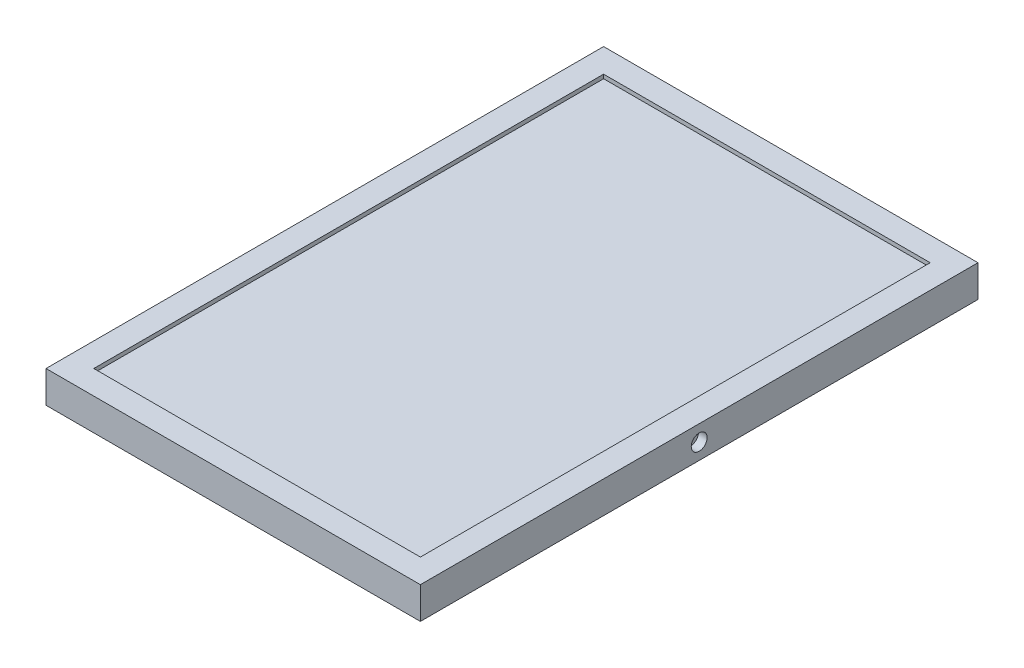
ISO-10303-21;
HEADER;
FILE_DESCRIPTION(('STEP AP214'),'2;1');
FILE_NAME('part.step','',(''),(''),'','','');
FILE_SCHEMA(('AUTOMOTIVE_DESIGN { 1 0 10303 214 1 1 1 1 }'));
ENDSEC;
DATA;
#1=APPLICATION_CONTEXT('core data for automotive mechanical design processes');
#2=APPLICATION_PROTOCOL_DEFINITION('international standard','automotive_design',2000,#1);
#3=PRODUCT_CONTEXT('',#1,'mechanical');
#4=PRODUCT('Part','Part','',(#3));
#5=PRODUCT_RELATED_PRODUCT_CATEGORY('part','',(#4));
#6=PRODUCT_DEFINITION_FORMATION('','',#4);
#7=PRODUCT_DEFINITION_CONTEXT('part definition',#1,'design');
#8=PRODUCT_DEFINITION('design','',#6,#7);
#9=PRODUCT_DEFINITION_SHAPE('','',#8);
#10=(LENGTH_UNIT() NAMED_UNIT(*) SI_UNIT(.MILLI.,.METRE.));
#11=(NAMED_UNIT(*) PLANE_ANGLE_UNIT() SI_UNIT($,.RADIAN.));
#12=(NAMED_UNIT(*) SI_UNIT($,.STERADIAN.) SOLID_ANGLE_UNIT());
#13=UNCERTAINTY_MEASURE_WITH_UNIT(LENGTH_MEASURE(1.E-05),#10,'distance_accuracy_value','');
#14=(GEOMETRIC_REPRESENTATION_CONTEXT(3) GLOBAL_UNCERTAINTY_ASSIGNED_CONTEXT((#13)) GLOBAL_UNIT_ASSIGNED_CONTEXT((#10,
#11,#12)) REPRESENTATION_CONTEXT('',''));
#15=CARTESIAN_POINT('',(0.,0.,0.));
#16=DIRECTION('',(0.,0.,1.));
#17=DIRECTION('',(1.,0.,0.));
#18=AXIS2_PLACEMENT_3D('',#15,#16,#17);
#19=CARTESIAN_POINT('',(0.,12.5,0.));
#20=DIRECTION('',(0.,1.,0.));
#21=DIRECTION('',(0.,0.,1.));
#22=AXIS2_PLACEMENT_3D('',#19,#20,#21);
#23=PLANE('',#22);
#24=DIRECTION('',(0.,0.,-1.));
#25=VECTOR('',#24,1.);
#26=CARTESIAN_POINT('',(-102.5,12.5,0.));
#27=LINE('',#26,#25);
#28=CARTESIAN_POINT('',(-102.5,12.5,160.));
#29=VERTEX_POINT('',#28);
#30=CARTESIAN_POINT('',(-102.5,12.5,-160.));
#31=VERTEX_POINT('',#30);
#32=EDGE_CURVE('E189',#29,#31,#27,.T.);
#33=ORIENTED_EDGE('',*,*,#32,.T.);
#34=DIRECTION('',(1.,0.,0.));
#35=VECTOR('',#34,1.);
#36=CARTESIAN_POINT('',(0.,12.5,-160.));
#37=LINE('',#36,#35);
#38=CARTESIAN_POINT('',(102.5,12.5,-160.));
#39=VERTEX_POINT('',#38);
#40=EDGE_CURVE('E197',#31,#39,#37,.T.);
#41=ORIENTED_EDGE('',*,*,#40,.T.);
#42=DIRECTION('',(0.,0.,-1.));
#43=VECTOR('',#42,1.);
#44=CARTESIAN_POINT('',(102.5,12.5,0.));
#45=LINE('',#44,#43);
#46=CARTESIAN_POINT('',(102.5,12.5,160.));
#47=VERTEX_POINT('',#46);
#48=EDGE_CURVE('E194',#47,#39,#45,.T.);
#49=ORIENTED_EDGE('',*,*,#48,.F.);
#50=DIRECTION('',(1.,0.,0.));
#51=VECTOR('',#50,1.);
#52=CARTESIAN_POINT('',(0.,12.5,160.));
#53=LINE('',#52,#51);
#54=EDGE_CURVE('E191',#29,#47,#53,.T.);
#55=ORIENTED_EDGE('',*,*,#54,.F.);
#56=EDGE_LOOP('',(#33,#41,#49,#55));
#57=FACE_BOUND('',#56,.T.);
#58=DIRECTION('',(0.,0.,1.));
#59=VECTOR('',#58,1.);
#60=CARTESIAN_POINT('',(71.25,12.5,-25.));
#61=LINE('',#60,#59);
#62=CARTESIAN_POINT('',(71.25,12.5,-25.));
#63=VERTEX_POINT('',#62);
#64=CARTESIAN_POINT('',(71.25,12.5,25.));
#65=VERTEX_POINT('',#64);
#66=EDGE_CURVE('E173',#63,#65,#61,.T.);
#67=ORIENTED_EDGE('',*,*,#66,.F.);
#68=DIRECTION('',(1.,0.,0.));
#69=VECTOR('',#68,1.);
#70=CARTESIAN_POINT('',(31.25,12.5,-25.));
#71=LINE('',#70,#69);
#72=CARTESIAN_POINT('',(31.25,12.5,-25.));
#73=VERTEX_POINT('',#72);
#74=EDGE_CURVE('E170',#73,#63,#71,.T.);
#75=ORIENTED_EDGE('',*,*,#74,.F.);
#76=DIRECTION('',(0.,0.,-1.));
#77=VECTOR('',#76,1.);
#78=CARTESIAN_POINT('',(31.25,12.5,-25.));
#79=LINE('',#78,#77);
#80=CARTESIAN_POINT('',(31.25,12.5,25.));
#81=VERTEX_POINT('',#80);
#82=EDGE_CURVE('E60',#81,#73,#79,.T.);
#83=ORIENTED_EDGE('',*,*,#82,.F.);
#84=DIRECTION('',(-1.,0.,0.));
#85=VECTOR('',#84,1.);
#86=CARTESIAN_POINT('',(31.25,12.5,25.));
#87=LINE('',#86,#85);
#88=EDGE_CURVE('E55',#65,#81,#87,.T.);
#89=ORIENTED_EDGE('',*,*,#88,.F.);
#90=EDGE_LOOP('',(#67,#75,#83,#89));
#91=FACE_BOUND('',#90,.T.);
#92=ADVANCED_FACE('F40',(#57,#91),#23,.F.);
#93=CARTESIAN_POINT('',(-102.5,20.,160.));
#94=DIRECTION('',(0.,0.,-1.));
#95=DIRECTION('',(-1.,0.,0.));
#96=AXIS2_PLACEMENT_3D('',#93,#94,#95);
#97=PLANE('',#96);
#98=DIRECTION('',(0.,-1.,0.));
#99=VECTOR('',#98,1.);
#100=CARTESIAN_POINT('',(-102.5,20.,160.));
#101=LINE('',#100,#99);
#102=CARTESIAN_POINT('',(-102.5,0.,160.));
#103=VERTEX_POINT('',#102);
#104=EDGE_CURVE('E210',#29,#103,#101,.T.);
#105=ORIENTED_EDGE('',*,*,#104,.F.);
#106=ORIENTED_EDGE('',*,*,#54,.T.);
#107=DIRECTION('',(0.,-1.,0.));
#108=VECTOR('',#107,1.);
#109=CARTESIAN_POINT('',(102.5,20.,160.));
#110=LINE('',#109,#108);
#111=CARTESIAN_POINT('',(102.5,0.,160.));
#112=VERTEX_POINT('',#111);
#113=EDGE_CURVE('E231',#47,#112,#110,.T.);
#114=ORIENTED_EDGE('',*,*,#113,.T.);
#115=DIRECTION('',(1.,0.,0.));
#116=VECTOR('',#115,1.);
#117=CARTESIAN_POINT('',(-102.5,0.,160.));
#118=LINE('',#117,#116);
#119=EDGE_CURVE('E199',#103,#112,#118,.T.);
#120=ORIENTED_EDGE('',*,*,#119,.F.);
#121=EDGE_LOOP('',(#105,#106,#114,#120));
#122=FACE_BOUND('',#121,.T.);
#123=ADVANCED_FACE('F291',(#122),#97,.T.);
#124=CARTESIAN_POINT('',(102.5,20.,160.));
#125=DIRECTION('',(-1.,0.,0.));
#126=DIRECTION('',(0.,0.,1.));
#127=AXIS2_PLACEMENT_3D('',#124,#125,#126);
#128=PLANE('',#127);
#129=ORIENTED_EDGE('',*,*,#113,.F.);
#130=ORIENTED_EDGE('',*,*,#48,.T.);
#131=DIRECTION('',(0.,-1.,0.));
#132=VECTOR('',#131,1.);
#133=CARTESIAN_POINT('',(102.5,20.,-160.));
#134=LINE('',#133,#132);
#135=CARTESIAN_POINT('',(102.5,0.,-160.));
#136=VERTEX_POINT('',#135);
#137=EDGE_CURVE('E227',#39,#136,#134,.T.);
#138=ORIENTED_EDGE('',*,*,#137,.T.);
#139=DIRECTION('',(0.,0.,-1.));
#140=VECTOR('',#139,1.);
#141=CARTESIAN_POINT('',(102.5,0.,160.));
#142=LINE('',#141,#140);
#143=EDGE_CURVE('E213',#112,#136,#142,.T.);
#144=ORIENTED_EDGE('',*,*,#143,.F.);
#145=EDGE_LOOP('',(#129,#130,#138,#144));
#146=FACE_BOUND('',#145,.T.);
#147=ADVANCED_FACE('F297',(#146),#128,.T.);
#148=CARTESIAN_POINT('',(-102.5,20.,-160.));
#149=DIRECTION('',(0.,0.,1.));
#150=DIRECTION('',(1.,0.,0.));
#151=AXIS2_PLACEMENT_3D('',#148,#149,#150);
#152=PLANE('',#151);
#153=ORIENTED_EDGE('',*,*,#137,.F.);
#154=ORIENTED_EDGE('',*,*,#40,.F.);
#155=DIRECTION('',(0.,-1.,0.));
#156=VECTOR('',#155,1.);
#157=CARTESIAN_POINT('',(-102.5,20.,-160.));
#158=LINE('',#157,#156);
#159=CARTESIAN_POINT('',(-102.5,0.,-160.));
#160=VERTEX_POINT('',#159);
#161=EDGE_CURVE('E223',#31,#160,#158,.T.);
#162=ORIENTED_EDGE('',*,*,#161,.T.);
#163=DIRECTION('',(-1.,0.,0.));
#164=VECTOR('',#163,1.);
#165=CARTESIAN_POINT('',(-102.5,0.,-160.));
#166=LINE('',#165,#164);
#167=EDGE_CURVE('E216',#136,#160,#166,.T.);
#168=ORIENTED_EDGE('',*,*,#167,.F.);
#169=EDGE_LOOP('',(#153,#154,#162,#168));
#170=FACE_BOUND('',#169,.T.);
#171=ADVANCED_FACE('F315',(#170),#152,.T.);
#172=CARTESIAN_POINT('',(-102.5,20.,160.));
#173=DIRECTION('',(1.,0.,0.));
#174=DIRECTION('',(0.,0.,-1.));
#175=AXIS2_PLACEMENT_3D('',#172,#173,#174);
#176=PLANE('',#175);
#177=ORIENTED_EDGE('',*,*,#161,.F.);
#178=ORIENTED_EDGE('',*,*,#32,.F.);
#179=ORIENTED_EDGE('',*,*,#104,.T.);
#180=DIRECTION('',(0.,0.,1.));
#181=VECTOR('',#180,1.);
#182=CARTESIAN_POINT('',(-102.5,0.,160.));
#183=LINE('',#182,#181);
#184=EDGE_CURVE('E203',#160,#103,#183,.T.);
#185=ORIENTED_EDGE('',*,*,#184,.F.);
#186=EDGE_LOOP('',(#177,#178,#179,#185));
#187=FACE_BOUND('',#186,.T.);
#188=ADVANCED_FACE('F310',(#187),#176,.T.);
#189=CARTESIAN_POINT('',(0.,20.,0.));
#190=DIRECTION('',(0.,-1.,0.));
#191=DIRECTION('',(0.,0.,-1.));
#192=AXIS2_PLACEMENT_3D('',#189,#190,#191);
#193=PLANE('',#192);
#194=DIRECTION('',(0.,0.,-1.));
#195=VECTOR('',#194,1.);
#196=CARTESIAN_POINT('',(117.5,20.,175.));
#197=LINE('',#196,#195);
#198=CARTESIAN_POINT('',(117.5,20.,175.));
#199=VERTEX_POINT('',#198);
#200=CARTESIAN_POINT('',(117.5,20.,-175.));
#201=VERTEX_POINT('',#200);
#202=EDGE_CURVE('E236',#199,#201,#197,.T.);
#203=ORIENTED_EDGE('',*,*,#202,.T.);
#204=DIRECTION('',(-1.,0.,0.));
#205=VECTOR('',#204,1.);
#206=CARTESIAN_POINT('',(-117.5,20.,-175.));
#207=LINE('',#206,#205);
#208=CARTESIAN_POINT('',(-117.5,20.,-175.));
#209=VERTEX_POINT('',#208);
#210=EDGE_CURVE('E239',#201,#209,#207,.T.);
#211=ORIENTED_EDGE('',*,*,#210,.T.);
#212=DIRECTION('',(0.,0.,1.));
#213=VECTOR('',#212,1.);
#214=CARTESIAN_POINT('',(-117.5,20.,175.));
#215=LINE('',#214,#213);
#216=CARTESIAN_POINT('',(-117.5,20.,175.));
#217=VERTEX_POINT('',#216);
#218=EDGE_CURVE('E242',#209,#217,#215,.T.);
#219=ORIENTED_EDGE('',*,*,#218,.T.);
#220=DIRECTION('',(1.,0.,0.));
#221=VECTOR('',#220,1.);
#222=CARTESIAN_POINT('',(-117.5,20.,175.));
#223=LINE('',#222,#221);
#224=EDGE_CURVE('E244',#217,#199,#223,.T.);
#225=ORIENTED_EDGE('',*,*,#224,.T.);
#226=EDGE_LOOP('',(#203,#211,#219,#225));
#227=FACE_BOUND('',#226,.T.);
#228=DIRECTION('',(1.,0.,0.));
#229=VECTOR('',#228,1.);
#230=CARTESIAN_POINT('',(-102.5,20.,160.));
#231=LINE('',#230,#229);
#232=CARTESIAN_POINT('',(-102.5,20.,160.));
#233=VERTEX_POINT('',#232);
#234=CARTESIAN_POINT('',(102.5,20.,160.));
#235=VERTEX_POINT('',#234);
#236=EDGE_CURVE('E200',#233,#235,#231,.T.);
#237=ORIENTED_EDGE('',*,*,#236,.F.);
#238=DIRECTION('',(0.,0.,1.));
#239=VECTOR('',#238,1.);
#240=CARTESIAN_POINT('',(-102.5,20.,160.));
#241=LINE('',#240,#239);
#242=CARTESIAN_POINT('',(-102.5,20.,-160.));
#243=VERTEX_POINT('',#242);
#244=EDGE_CURVE('E208',#243,#233,#241,.T.);
#245=ORIENTED_EDGE('',*,*,#244,.F.);
#246=DIRECTION('',(-1.,0.,0.));
#247=VECTOR('',#246,1.);
#248=CARTESIAN_POINT('',(-102.5,20.,-160.));
#249=LINE('',#248,#247);
#250=CARTESIAN_POINT('',(102.5,20.,-160.));
#251=VERTEX_POINT('',#250);
#252=EDGE_CURVE('E205',#251,#243,#249,.T.);
#253=ORIENTED_EDGE('',*,*,#252,.F.);
#254=DIRECTION('',(0.,0.,-1.));
#255=VECTOR('',#254,1.);
#256=CARTESIAN_POINT('',(102.5,20.,160.));
#257=LINE('',#256,#255);
#258=EDGE_CURVE('E202',#235,#251,#257,.T.);
#259=ORIENTED_EDGE('',*,*,#258,.F.);
#260=EDGE_LOOP('',(#237,#245,#253,#259));
#261=FACE_BOUND('',#260,.T.);
#262=ADVANCED_FACE('F279',(#227,#261),#193,.F.);
#263=CARTESIAN_POINT('',(0.,0.,0.));
#264=DIRECTION('',(0.,-1.,0.));
#265=DIRECTION('',(0.,0.,-1.));
#266=AXIS2_PLACEMENT_3D('',#263,#264,#265);
#267=PLANE('',#266);
#268=DIRECTION('',(0.,0.,-1.));
#269=VECTOR('',#268,1.);
#270=CARTESIAN_POINT('',(117.5,0.,175.));
#271=LINE('',#270,#269);
#272=CARTESIAN_POINT('',(117.5,0.,175.));
#273=VERTEX_POINT('',#272);
#274=CARTESIAN_POINT('',(117.5,0.,-175.));
#275=VERTEX_POINT('',#274);
#276=EDGE_CURVE('E235',#273,#275,#271,.T.);
#277=ORIENTED_EDGE('',*,*,#276,.F.);
#278=DIRECTION('',(1.,0.,0.));
#279=VECTOR('',#278,1.);
#280=CARTESIAN_POINT('',(-117.5,0.,175.));
#281=LINE('',#280,#279);
#282=CARTESIAN_POINT('',(-117.5,0.,175.));
#283=VERTEX_POINT('',#282);
#284=EDGE_CURVE('E240',#283,#273,#281,.T.);
#285=ORIENTED_EDGE('',*,*,#284,.F.);
#286=DIRECTION('',(0.,0.,1.));
#287=VECTOR('',#286,1.);
#288=CARTESIAN_POINT('',(-117.5,0.,175.));
#289=LINE('',#288,#287);
#290=CARTESIAN_POINT('',(-117.5,0.,-175.));
#291=VERTEX_POINT('',#290);
#292=EDGE_CURVE('E251',#291,#283,#289,.T.);
#293=ORIENTED_EDGE('',*,*,#292,.F.);
#294=DIRECTION('',(-1.,0.,0.));
#295=VECTOR('',#294,1.);
#296=CARTESIAN_POINT('',(-117.5,0.,-175.));
#297=LINE('',#296,#295);
#298=EDGE_CURVE('E249',#275,#291,#297,.T.);
#299=ORIENTED_EDGE('',*,*,#298,.F.);
#300=EDGE_LOOP('',(#277,#285,#293,#299));
#301=FACE_BOUND('',#300,.T.);
#302=ORIENTED_EDGE('',*,*,#184,.T.);
#303=ORIENTED_EDGE('',*,*,#119,.T.);
#304=ORIENTED_EDGE('',*,*,#143,.T.);
#305=ORIENTED_EDGE('',*,*,#167,.T.);
#306=EDGE_LOOP('',(#302,#303,#304,#305));
#307=FACE_BOUND('',#306,.T.);
#308=ADVANCED_FACE('F269',(#301,#307),#267,.T.);
#309=CARTESIAN_POINT('',(117.5,20.,175.));
#310=DIRECTION('',(-1.,0.,0.));
#311=DIRECTION('',(0.,0.,1.));
#312=AXIS2_PLACEMENT_3D('',#309,#310,#311);
#313=PLANE('',#312);
#314=CARTESIAN_POINT('',(117.5,10.,0.));
#315=DIRECTION('',(-1.,0.,0.));
#316=DIRECTION('',(0.,0.,1.));
#317=AXIS2_PLACEMENT_3D('',#314,#315,#316);
#318=CIRCLE('',#317,5.);
#319=CARTESIAN_POINT('',(117.5,10.,4.99999999999999));
#320=VERTEX_POINT('',#319);
#321=EDGE_CURVE('E589',#320,#320,#318,.T.);
#322=ORIENTED_EDGE('',*,*,#321,.T.);
#323=EDGE_LOOP('',(#322));
#324=FACE_BOUND('',#323,.T.);
#325=ORIENTED_EDGE('',*,*,#276,.T.);
#326=DIRECTION('',(0.,-1.,0.));
#327=VECTOR('',#326,1.);
#328=CARTESIAN_POINT('',(117.5,20.,-175.));
#329=LINE('',#328,#327);
#330=EDGE_CURVE('E11',#201,#275,#329,.T.);
#331=ORIENTED_EDGE('',*,*,#330,.F.);
#332=ORIENTED_EDGE('',*,*,#202,.F.);
#333=DIRECTION('',(0.,-1.,0.));
#334=VECTOR('',#333,1.);
#335=CARTESIAN_POINT('',(117.5,20.,175.));
#336=LINE('',#335,#334);
#337=EDGE_CURVE('E246',#199,#273,#336,.T.);
#338=ORIENTED_EDGE('',*,*,#337,.T.);
#339=EDGE_LOOP('',(#325,#331,#332,#338));
#340=FACE_BOUND('',#339,.T.);
#341=ADVANCED_FACE('F42',(#324,#340),#313,.F.);
#342=CARTESIAN_POINT('',(-117.5,20.,-175.));
#343=DIRECTION('',(0.,0.,1.));
#344=DIRECTION('',(1.,0.,0.));
#345=AXIS2_PLACEMENT_3D('',#342,#343,#344);
#346=PLANE('',#345);
#347=ORIENTED_EDGE('',*,*,#298,.T.);
#348=DIRECTION('',(0.,-1.,0.));
#349=VECTOR('',#348,1.);
#350=CARTESIAN_POINT('',(-117.5,20.,-175.));
#351=LINE('',#350,#349);
#352=EDGE_CURVE('E48',#209,#291,#351,.T.);
#353=ORIENTED_EDGE('',*,*,#352,.F.);
#354=ORIENTED_EDGE('',*,*,#210,.F.);
#355=ORIENTED_EDGE('',*,*,#330,.T.);
#356=EDGE_LOOP('',(#347,#353,#354,#355));
#357=FACE_BOUND('',#356,.T.);
#358=ADVANCED_FACE('F281',(#357),#346,.F.);
#359=CARTESIAN_POINT('',(-117.5,20.,175.));
#360=DIRECTION('',(1.,0.,0.));
#361=DIRECTION('',(0.,0.,-1.));
#362=AXIS2_PLACEMENT_3D('',#359,#360,#361);
#363=PLANE('',#362);
#364=CARTESIAN_POINT('',(-117.5,10.,0.));
#365=DIRECTION('',(-1.,0.,0.));
#366=DIRECTION('',(0.,0.,1.));
#367=AXIS2_PLACEMENT_3D('',#364,#365,#366);
#368=CIRCLE('',#367,5.);
#369=CARTESIAN_POINT('',(-117.5,10.,4.99999999999999));
#370=VERTEX_POINT('',#369);
#371=EDGE_CURVE('E588',#370,#370,#368,.T.);
#372=ORIENTED_EDGE('',*,*,#371,.F.);
#373=EDGE_LOOP('',(#372));
#374=FACE_BOUND('',#373,.T.);
#375=ORIENTED_EDGE('',*,*,#292,.T.);
#376=DIRECTION('',(0.,-1.,0.));
#377=VECTOR('',#376,1.);
#378=CARTESIAN_POINT('',(-117.5,20.,175.));
#379=LINE('',#378,#377);
#380=EDGE_CURVE('E256',#217,#283,#379,.T.);
#381=ORIENTED_EDGE('',*,*,#380,.F.);
#382=ORIENTED_EDGE('',*,*,#218,.F.);
#383=ORIENTED_EDGE('',*,*,#352,.T.);
#384=EDGE_LOOP('',(#375,#381,#382,#383));
#385=FACE_BOUND('',#384,.T.);
#386=ADVANCED_FACE('F263',(#374,#385),#363,.F.);
#387=CARTESIAN_POINT('',(-117.5,20.,175.));
#388=DIRECTION('',(0.,0.,-1.));
#389=DIRECTION('',(-1.,0.,0.));
#390=AXIS2_PLACEMENT_3D('',#387,#388,#389);
#391=PLANE('',#390);
#392=ORIENTED_EDGE('',*,*,#284,.T.);
#393=ORIENTED_EDGE('',*,*,#337,.F.);
#394=ORIENTED_EDGE('',*,*,#224,.F.);
#395=ORIENTED_EDGE('',*,*,#380,.T.);
#396=EDGE_LOOP('',(#392,#393,#394,#395));
#397=FACE_BOUND('',#396,.T.);
#398=ADVANCED_FACE('F273',(#397),#391,.F.);
#399=DIRECTION('',(1.,0.,0.));
#400=VECTOR('',#399,1.);
#401=CARTESIAN_POINT('',(0.,17.5,160.));
#402=LINE('',#401,#400);
#403=CARTESIAN_POINT('',(-102.5,17.5,160.));
#404=VERTEX_POINT('',#403);
#405=CARTESIAN_POINT('',(102.5,17.5,160.));
#406=VERTEX_POINT('',#405);
#407=EDGE_CURVE('E176',#404,#406,#402,.T.);
#408=ORIENTED_EDGE('',*,*,#407,.F.);
#409=EDGE_CURVE('E221',#233,#404,#101,.T.);
#410=ORIENTED_EDGE('',*,*,#409,.F.);
#411=ORIENTED_EDGE('',*,*,#236,.T.);
#412=EDGE_CURVE('E232',#235,#406,#110,.T.);
#413=ORIENTED_EDGE('',*,*,#412,.T.);
#414=EDGE_LOOP('',(#408,#410,#411,#413));
#415=FACE_BOUND('',#414,.T.);
#416=ADVANCED_FACE('F300',(#415),#97,.T.);
#417=DIRECTION('',(0.,0.,-1.));
#418=VECTOR('',#417,1.);
#419=CARTESIAN_POINT('',(102.5,17.5,0.));
#420=LINE('',#419,#418);
#421=CARTESIAN_POINT('',(102.5,17.5,-160.));
#422=VERTEX_POINT('',#421);
#423=EDGE_CURVE('E184',#406,#422,#420,.T.);
#424=ORIENTED_EDGE('',*,*,#423,.F.);
#425=ORIENTED_EDGE('',*,*,#412,.F.);
#426=ORIENTED_EDGE('',*,*,#258,.T.);
#427=EDGE_CURVE('E228',#251,#422,#134,.T.);
#428=ORIENTED_EDGE('',*,*,#427,.T.);
#429=EDGE_LOOP('',(#424,#425,#426,#428));
#430=FACE_BOUND('',#429,.T.);
#431=ADVANCED_FACE('F313',(#430),#128,.T.);
#432=DIRECTION('',(1.,0.,0.));
#433=VECTOR('',#432,1.);
#434=CARTESIAN_POINT('',(0.,17.5,-160.));
#435=LINE('',#434,#433);
#436=CARTESIAN_POINT('',(-102.5,17.5,-160.));
#437=VERTEX_POINT('',#436);
#438=EDGE_CURVE('E187',#437,#422,#435,.T.);
#439=ORIENTED_EDGE('',*,*,#438,.T.);
#440=ORIENTED_EDGE('',*,*,#427,.F.);
#441=ORIENTED_EDGE('',*,*,#252,.T.);
#442=EDGE_CURVE('E224',#243,#437,#158,.T.);
#443=ORIENTED_EDGE('',*,*,#442,.T.);
#444=EDGE_LOOP('',(#439,#440,#441,#443));
#445=FACE_BOUND('',#444,.T.);
#446=ADVANCED_FACE('F308',(#445),#152,.T.);
#447=DIRECTION('',(0.,0.,-1.));
#448=VECTOR('',#447,1.);
#449=CARTESIAN_POINT('',(-102.5,17.5,0.));
#450=LINE('',#449,#448);
#451=EDGE_CURVE('E174',#404,#437,#450,.T.);
#452=ORIENTED_EDGE('',*,*,#451,.T.);
#453=ORIENTED_EDGE('',*,*,#442,.F.);
#454=ORIENTED_EDGE('',*,*,#244,.T.);
#455=ORIENTED_EDGE('',*,*,#409,.T.);
#456=EDGE_LOOP('',(#452,#453,#454,#455));
#457=FACE_BOUND('',#456,.T.);
#458=ADVANCED_FACE('F305',(#457),#176,.T.);
#459=CARTESIAN_POINT('',(0.,17.5,0.));
#460=DIRECTION('',(0.,1.,0.));
#461=DIRECTION('',(0.,0.,1.));
#462=AXIS2_PLACEMENT_3D('',#459,#460,#461);
#463=PLANE('',#462);
#464=ORIENTED_EDGE('',*,*,#451,.F.);
#465=ORIENTED_EDGE('',*,*,#407,.T.);
#466=ORIENTED_EDGE('',*,*,#423,.T.);
#467=ORIENTED_EDGE('',*,*,#438,.F.);
#468=EDGE_LOOP('',(#464,#465,#466,#467));
#469=FACE_BOUND('',#468,.T.);
#470=ADVANCED_FACE('F303',(#469),#463,.T.);
#471=CARTESIAN_POINT('',(71.25,0.,-25.));
#472=DIRECTION('',(-1.,0.,0.));
#473=DIRECTION('',(0.,0.,1.));
#474=AXIS2_PLACEMENT_3D('',#471,#472,#473);
#475=PLANE('',#474);
#476=ORIENTED_EDGE('',*,*,#66,.T.);
#477=DIRECTION('',(0.,1.,0.));
#478=VECTOR('',#477,1.);
#479=CARTESIAN_POINT('',(71.25,0.,25.));
#480=LINE('',#479,#478);
#481=CARTESIAN_POINT('',(71.25,0.,25.));
#482=VERTEX_POINT('',#481);
#483=EDGE_CURVE('E154',#482,#65,#480,.T.);
#484=ORIENTED_EDGE('',*,*,#483,.F.);
#485=DIRECTION('',(0.,0.,1.));
#486=VECTOR('',#485,1.);
#487=CARTESIAN_POINT('',(71.25,0.,-25.));
#488=LINE('',#487,#486);
#489=CARTESIAN_POINT('',(71.25,0.,-25.));
#490=VERTEX_POINT('',#489);
#491=EDGE_CURVE('E161',#490,#482,#488,.T.);
#492=ORIENTED_EDGE('',*,*,#491,.F.);
#493=DIRECTION('',(0.,1.,0.));
#494=VECTOR('',#493,1.);
#495=CARTESIAN_POINT('',(71.25,0.,-25.));
#496=LINE('',#495,#494);
#497=EDGE_CURVE('E601',#490,#63,#496,.T.);
#498=ORIENTED_EDGE('',*,*,#497,.T.);
#499=EDGE_LOOP('',(#476,#484,#492,#498));
#500=FACE_BOUND('',#499,.T.);
#501=ADVANCED_FACE('F172',(#500),#475,.F.);
#502=CARTESIAN_POINT('',(31.25,0.,25.));
#503=DIRECTION('',(0.,0.,-1.));
#504=DIRECTION('',(-1.,0.,0.));
#505=AXIS2_PLACEMENT_3D('',#502,#503,#504);
#506=PLANE('',#505);
#507=ORIENTED_EDGE('',*,*,#88,.T.);
#508=DIRECTION('',(0.,1.,0.));
#509=VECTOR('',#508,1.);
#510=CARTESIAN_POINT('',(31.25,0.,25.));
#511=LINE('',#510,#509);
#512=CARTESIAN_POINT('',(31.25,0.,25.));
#513=VERTEX_POINT('',#512);
#514=EDGE_CURVE('E157',#513,#81,#511,.T.);
#515=ORIENTED_EDGE('',*,*,#514,.F.);
#516=DIRECTION('',(-1.,0.,0.));
#517=VECTOR('',#516,1.);
#518=CARTESIAN_POINT('',(31.25,0.,25.));
#519=LINE('',#518,#517);
#520=EDGE_CURVE('E150',#482,#513,#519,.T.);
#521=ORIENTED_EDGE('',*,*,#520,.F.);
#522=ORIENTED_EDGE('',*,*,#483,.T.);
#523=EDGE_LOOP('',(#507,#515,#521,#522));
#524=FACE_BOUND('',#523,.T.);
#525=ADVANCED_FACE('F152',(#524),#506,.F.);
#526=CARTESIAN_POINT('',(31.25,0.,-25.));
#527=DIRECTION('',(1.,0.,0.));
#528=DIRECTION('',(0.,0.,-1.));
#529=AXIS2_PLACEMENT_3D('',#526,#527,#528);
#530=PLANE('',#529);
#531=ORIENTED_EDGE('',*,*,#82,.T.);
#532=DIRECTION('',(0.,1.,0.));
#533=VECTOR('',#532,1.);
#534=CARTESIAN_POINT('',(31.25,0.,-25.));
#535=LINE('',#534,#533);
#536=CARTESIAN_POINT('',(31.25,0.,-25.));
#537=VERTEX_POINT('',#536);
#538=EDGE_CURVE('E178',#537,#73,#535,.T.);
#539=ORIENTED_EDGE('',*,*,#538,.F.);
#540=DIRECTION('',(0.,0.,-1.));
#541=VECTOR('',#540,1.);
#542=CARTESIAN_POINT('',(31.25,0.,-25.));
#543=LINE('',#542,#541);
#544=EDGE_CURVE('E160',#513,#537,#543,.T.);
#545=ORIENTED_EDGE('',*,*,#544,.F.);
#546=ORIENTED_EDGE('',*,*,#514,.T.);
#547=EDGE_LOOP('',(#531,#539,#545,#546));
#548=FACE_BOUND('',#547,.T.);
#549=ADVANCED_FACE('F367',(#548),#530,.F.);
#550=CARTESIAN_POINT('',(31.25,0.,-25.));
#551=DIRECTION('',(0.,0.,1.));
#552=DIRECTION('',(1.,0.,0.));
#553=AXIS2_PLACEMENT_3D('',#550,#551,#552);
#554=PLANE('',#553);
#555=ORIENTED_EDGE('',*,*,#74,.T.);
#556=ORIENTED_EDGE('',*,*,#497,.F.);
#557=DIRECTION('',(1.,0.,0.));
#558=VECTOR('',#557,1.);
#559=CARTESIAN_POINT('',(31.25,0.,-25.));
#560=LINE('',#559,#558);
#561=EDGE_CURVE('E166',#537,#490,#560,.T.);
#562=ORIENTED_EDGE('',*,*,#561,.F.);
#563=ORIENTED_EDGE('',*,*,#538,.T.);
#564=EDGE_LOOP('',(#555,#556,#562,#563));
#565=FACE_BOUND('',#564,.T.);
#566=ADVANCED_FACE('F374',(#565),#554,.F.);
#567=CARTESIAN_POINT('',(0.,0.,0.));
#568=DIRECTION('',(0.,1.,0.));
#569=DIRECTION('',(0.,0.,1.));
#570=AXIS2_PLACEMENT_3D('',#567,#568,#569);
#571=PLANE('',#570);
#572=ORIENTED_EDGE('',*,*,#491,.T.);
#573=ORIENTED_EDGE('',*,*,#520,.T.);
#574=ORIENTED_EDGE('',*,*,#544,.T.);
#575=ORIENTED_EDGE('',*,*,#561,.T.);
#576=EDGE_LOOP('',(#572,#573,#574,#575));
#577=FACE_BOUND('',#576,.T.);
#578=ADVANCED_FACE('F164',(#577),#571,.F.);
#579=CARTESIAN_POINT('',(-112.,10.,0.));
#580=DIRECTION('',(-1.,0.,0.));
#581=DIRECTION('',(0.,0.,1.));
#582=AXIS2_PLACEMENT_3D('',#579,#580,#581);
#583=CYLINDRICAL_SURFACE('',#582,5.);
#584=CARTESIAN_POINT('',(-112.,10.,0.));
#585=DIRECTION('',(-1.,0.,0.));
#586=DIRECTION('',(0.,0.,1.));
#587=AXIS2_PLACEMENT_3D('',#584,#585,#586);
#588=CIRCLE('',#587,5.);
#589=CARTESIAN_POINT('',(-112.,10.,4.99999999999999));
#590=VERTEX_POINT('',#589);
#591=EDGE_CURVE('E592',#590,#590,#588,.T.);
#592=ORIENTED_EDGE('',*,*,#591,.F.);
#593=EDGE_LOOP('',(#592));
#594=FACE_BOUND('',#593,.T.);
#595=ORIENTED_EDGE('',*,*,#371,.T.);
#596=EDGE_LOOP('',(#595));
#597=FACE_BOUND('',#596,.T.);
#598=ADVANCED_FACE('F387',(#594,#597),#583,.F.);
#599=CARTESIAN_POINT('',(-112.,10.,0.));
#600=DIRECTION('',(-1.,0.,0.));
#601=DIRECTION('',(0.,0.,1.));
#602=AXIS2_PLACEMENT_3D('',#599,#600,#601);
#603=PLANE('',#602);
#604=ORIENTED_EDGE('',*,*,#591,.T.);
#605=EDGE_LOOP('',(#604));
#606=FACE_BOUND('',#605,.T.);
#607=ADVANCED_FACE('F394',(#606),#603,.T.);
#608=CARTESIAN_POINT('',(112.,10.,0.));
#609=DIRECTION('',(1.,0.,0.));
#610=DIRECTION('',(0.,0.,-1.));
#611=AXIS2_PLACEMENT_3D('',#608,#609,#610);
#612=CYLINDRICAL_SURFACE('',#611,5.);
#613=CARTESIAN_POINT('',(112.,10.,0.));
#614=DIRECTION('',(-1.,0.,0.));
#615=DIRECTION('',(0.,0.,1.));
#616=AXIS2_PLACEMENT_3D('',#613,#614,#615);
#617=CIRCLE('',#616,5.);
#618=CARTESIAN_POINT('',(112.,10.,4.99999999999999));
#619=VERTEX_POINT('',#618);
#620=EDGE_CURVE('E587',#619,#619,#617,.T.);
#621=ORIENTED_EDGE('',*,*,#620,.T.);
#622=EDGE_LOOP('',(#621));
#623=FACE_BOUND('',#622,.T.);
#624=ORIENTED_EDGE('',*,*,#321,.F.);
#625=EDGE_LOOP('',(#624));
#626=FACE_BOUND('',#625,.T.);
#627=ADVANCED_FACE('F403',(#623,#626),#612,.F.);
#628=CARTESIAN_POINT('',(112.,10.,0.));
#629=DIRECTION('',(-1.,0.,0.));
#630=DIRECTION('',(0.,0.,1.));
#631=AXIS2_PLACEMENT_3D('',#628,#629,#630);
#632=PLANE('',#631);
#633=ORIENTED_EDGE('',*,*,#620,.F.);
#634=EDGE_LOOP('',(#633));
#635=FACE_BOUND('',#634,.T.);
#636=ADVANCED_FACE('F412',(#635),#632,.F.);
#637=CLOSED_SHELL('',(#92,#123,#147,#171,#188,#262,#308,#341,#358,#386,#398,#416,#431,#446,#458,
#470,#501,#525,#549,#566,#578,#598,#607,#627,#636));
#638=MANIFOLD_SOLID_BREP('B2',#637);
#639=ADVANCED_BREP_SHAPE_REPRESENTATION('',(#18,#638),#14);
#640=SHAPE_DEFINITION_REPRESENTATION(#9,#639);
ENDSEC;
END-ISO-10303-21;
